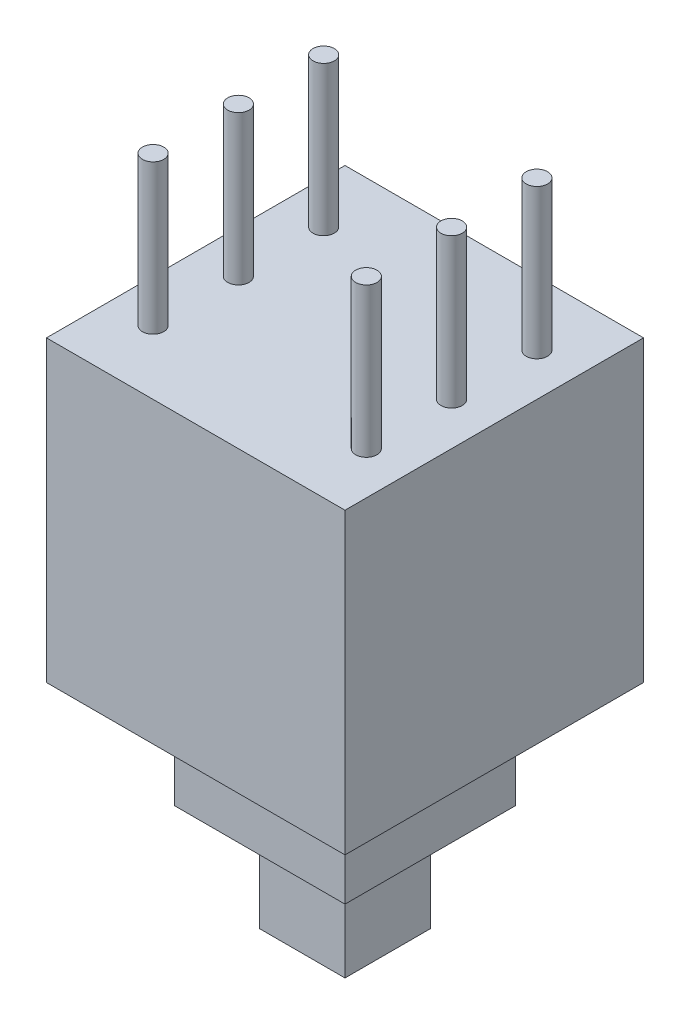
ISO-10303-21;
HEADER;
FILE_DESCRIPTION(('STEP AP214'),'2;1');
FILE_NAME('part.step','',(''),(''),'','','');
FILE_SCHEMA(('AUTOMOTIVE_DESIGN { 1 0 10303 214 1 1 1 1 }'));
ENDSEC;
DATA;
#1=APPLICATION_CONTEXT('core data for automotive mechanical design processes');
#2=APPLICATION_PROTOCOL_DEFINITION('international standard','automotive_design',2000,#1);
#3=PRODUCT_CONTEXT('',#1,'mechanical');
#4=PRODUCT('Part','Part','',(#3));
#5=PRODUCT_RELATED_PRODUCT_CATEGORY('part','',(#4));
#6=PRODUCT_DEFINITION_FORMATION('','',#4);
#7=PRODUCT_DEFINITION_CONTEXT('part definition',#1,'design');
#8=PRODUCT_DEFINITION('design','',#6,#7);
#9=PRODUCT_DEFINITION_SHAPE('','',#8);
#10=(LENGTH_UNIT() NAMED_UNIT(*) SI_UNIT(.MILLI.,.METRE.));
#11=(NAMED_UNIT(*) PLANE_ANGLE_UNIT() SI_UNIT($,.RADIAN.));
#12=(NAMED_UNIT(*) SI_UNIT($,.STERADIAN.) SOLID_ANGLE_UNIT());
#13=UNCERTAINTY_MEASURE_WITH_UNIT(LENGTH_MEASURE(1.E-05),#10,'distance_accuracy_value','');
#14=(GEOMETRIC_REPRESENTATION_CONTEXT(3) GLOBAL_UNCERTAINTY_ASSIGNED_CONTEXT((#13)) GLOBAL_UNIT_ASSIGNED_CONTEXT((#10,
#11,#12)) REPRESENTATION_CONTEXT('',''));
#15=CARTESIAN_POINT('',(0.,0.,0.));
#16=DIRECTION('',(0.,0.,1.));
#17=DIRECTION('',(1.,0.,0.));
#18=AXIS2_PLACEMENT_3D('',#15,#16,#17);
#19=CARTESIAN_POINT('',(1.,-5.,1.));
#20=DIRECTION('',(0.,1.,0.));
#21=DIRECTION('',(0.,0.,1.));
#22=AXIS2_PLACEMENT_3D('',#19,#20,#21);
#23=PLANE('',#22);
#24=DIRECTION('',(-1.,0.,0.));
#25=VECTOR('',#24,1.);
#26=CARTESIAN_POINT('',(-1.,-5.,1.));
#27=LINE('',#26,#25);
#28=CARTESIAN_POINT('',(1.,-5.,1.));
#29=VERTEX_POINT('',#28);
#30=CARTESIAN_POINT('',(-1.,-5.,1.));
#31=VERTEX_POINT('',#30);
#32=EDGE_CURVE('E105',#29,#31,#27,.T.);
#33=ORIENTED_EDGE('',*,*,#32,.T.);
#34=DIRECTION('',(0.,0.,-1.));
#35=VECTOR('',#34,1.);
#36=CARTESIAN_POINT('',(-1.,-5.,-1.));
#37=LINE('',#36,#35);
#38=CARTESIAN_POINT('',(-1.,-5.,-1.));
#39=VERTEX_POINT('',#38);
#40=EDGE_CURVE('E102',#31,#39,#37,.T.);
#41=ORIENTED_EDGE('',*,*,#40,.T.);
#42=DIRECTION('',(1.,0.,0.));
#43=VECTOR('',#42,1.);
#44=CARTESIAN_POINT('',(-1.,-5.,-1.));
#45=LINE('',#44,#43);
#46=CARTESIAN_POINT('',(1.,-5.,-1.));
#47=VERTEX_POINT('',#46);
#48=EDGE_CURVE('E188',#39,#47,#45,.T.);
#49=ORIENTED_EDGE('',*,*,#48,.T.);
#50=DIRECTION('',(0.,0.,1.));
#51=VECTOR('',#50,1.);
#52=CARTESIAN_POINT('',(1.,-5.,-1.));
#53=LINE('',#52,#51);
#54=EDGE_CURVE('E107',#47,#29,#53,.T.);
#55=ORIENTED_EDGE('',*,*,#54,.T.);
#56=EDGE_LOOP('',(#33,#41,#49,#55));
#57=FACE_BOUND('',#56,.T.);
#58=ADVANCED_FACE('F17',(#57),#23,.F.);
#59=CARTESIAN_POINT('',(-1.,-5.,1.));
#60=DIRECTION('',(0.,0.,-1.));
#61=DIRECTION('',(-1.,0.,0.));
#62=AXIS2_PLACEMENT_3D('',#59,#60,#61);
#63=PLANE('',#62);
#64=DIRECTION('',(0.,1.,0.));
#65=VECTOR('',#64,1.);
#66=CARTESIAN_POINT('',(-1.,-5.,1.));
#67=LINE('',#66,#65);
#68=CARTESIAN_POINT('',(-1.,-2.5,1.));
#69=VERTEX_POINT('',#68);
#70=EDGE_CURVE('E112',#69,#31,#67,.F.);
#71=ORIENTED_EDGE('',*,*,#70,.T.);
#72=ORIENTED_EDGE('',*,*,#32,.F.);
#73=DIRECTION('',(0.,1.,0.));
#74=VECTOR('',#73,1.);
#75=CARTESIAN_POINT('',(1.,-5.,1.));
#76=LINE('',#75,#74);
#77=CARTESIAN_POINT('',(1.,-2.5,1.));
#78=VERTEX_POINT('',#77);
#79=EDGE_CURVE('E182',#29,#78,#76,.T.);
#80=ORIENTED_EDGE('',*,*,#79,.T.);
#81=DIRECTION('',(1.,0.,0.));
#82=VECTOR('',#81,1.);
#83=CARTESIAN_POINT('',(2.,-2.5,1.));
#84=LINE('',#83,#82);
#85=EDGE_CURVE('E123',#78,#69,#84,.F.);
#86=ORIENTED_EDGE('',*,*,#85,.T.);
#87=EDGE_LOOP('',(#71,#72,#80,#86));
#88=FACE_BOUND('',#87,.T.);
#89=ADVANCED_FACE('F122',(#88),#63,.F.);
#90=CARTESIAN_POINT('',(-1.,-5.,-1.));
#91=DIRECTION('',(1.,0.,0.));
#92=DIRECTION('',(0.,0.,-1.));
#93=AXIS2_PLACEMENT_3D('',#90,#91,#92);
#94=PLANE('',#93);
#95=DIRECTION('',(0.,1.,0.));
#96=VECTOR('',#95,1.);
#97=CARTESIAN_POINT('',(-1.,-5.,-1.));
#98=LINE('',#97,#96);
#99=CARTESIAN_POINT('',(-1.,-2.5,-1.));
#100=VERTEX_POINT('',#99);
#101=EDGE_CURVE('E119',#100,#39,#98,.F.);
#102=ORIENTED_EDGE('',*,*,#101,.T.);
#103=ORIENTED_EDGE('',*,*,#40,.F.);
#104=ORIENTED_EDGE('',*,*,#70,.F.);
#105=DIRECTION('',(0.,0.,1.));
#106=VECTOR('',#105,1.);
#107=CARTESIAN_POINT('',(-1.,-2.5,2.));
#108=LINE('',#107,#106);
#109=EDGE_CURVE('E175',#69,#100,#108,.F.);
#110=ORIENTED_EDGE('',*,*,#109,.T.);
#111=EDGE_LOOP('',(#102,#103,#104,#110));
#112=FACE_BOUND('',#111,.T.);
#113=ADVANCED_FACE('F116',(#112),#94,.F.);
#114=CARTESIAN_POINT('',(-1.,-5.,-1.));
#115=DIRECTION('',(0.,0.,1.));
#116=DIRECTION('',(1.,0.,0.));
#117=AXIS2_PLACEMENT_3D('',#114,#115,#116);
#118=PLANE('',#117);
#119=DIRECTION('',(0.,1.,0.));
#120=VECTOR('',#119,1.);
#121=CARTESIAN_POINT('',(1.,-5.,-1.));
#122=LINE('',#121,#120);
#123=CARTESIAN_POINT('',(1.,-2.5,-1.));
#124=VERTEX_POINT('',#123);
#125=EDGE_CURVE('E185',#124,#47,#122,.F.);
#126=ORIENTED_EDGE('',*,*,#125,.T.);
#127=ORIENTED_EDGE('',*,*,#48,.F.);
#128=ORIENTED_EDGE('',*,*,#101,.F.);
#129=DIRECTION('',(1.,0.,0.));
#130=VECTOR('',#129,1.);
#131=CARTESIAN_POINT('',(2.,-2.5,-1.));
#132=LINE('',#131,#130);
#133=EDGE_CURVE('E170',#100,#124,#132,.T.);
#134=ORIENTED_EDGE('',*,*,#133,.T.);
#135=EDGE_LOOP('',(#126,#127,#128,#134));
#136=FACE_BOUND('',#135,.T.);
#137=ADVANCED_FACE('F191',(#136),#118,.F.);
#138=CARTESIAN_POINT('',(1.,-5.,-1.));
#139=DIRECTION('',(-1.,0.,0.));
#140=DIRECTION('',(0.,0.,1.));
#141=AXIS2_PLACEMENT_3D('',#138,#139,#140);
#142=PLANE('',#141);
#143=ORIENTED_EDGE('',*,*,#79,.F.);
#144=ORIENTED_EDGE('',*,*,#54,.F.);
#145=ORIENTED_EDGE('',*,*,#125,.F.);
#146=DIRECTION('',(0.,0.,1.));
#147=VECTOR('',#146,1.);
#148=CARTESIAN_POINT('',(1.,-2.5,2.));
#149=LINE('',#148,#147);
#150=EDGE_CURVE('E166',#124,#78,#149,.T.);
#151=ORIENTED_EDGE('',*,*,#150,.T.);
#152=EDGE_LOOP('',(#143,#144,#145,#151));
#153=FACE_BOUND('',#152,.T.);
#154=ADVANCED_FACE('F190',(#153),#142,.F.);
#155=CARTESIAN_POINT('',(2.5,10.5,-2.));
#156=DIRECTION('',(0.,-1.,0.));
#157=DIRECTION('',(0.,0.,-1.));
#158=AXIS2_PLACEMENT_3D('',#155,#156,#157);
#159=PLANE('',#158);
#160=CARTESIAN_POINT('',(2.5,10.5,-2.));
#161=DIRECTION('',(0.,-1.,0.));
#162=DIRECTION('',(0.,0.,-1.));
#163=AXIS2_PLACEMENT_3D('',#160,#161,#162);
#164=CIRCLE('',#163,0.25);
#165=CARTESIAN_POINT('',(2.5,10.5,-2.25));
#166=VERTEX_POINT('',#165);
#167=EDGE_CURVE('E20',#166,#166,#164,.T.);
#168=ORIENTED_EDGE('',*,*,#167,.F.);
#169=EDGE_LOOP('',(#168));
#170=FACE_BOUND('',#169,.T.);
#171=ADVANCED_FACE('F351',(#170),#159,.F.);
#172=CARTESIAN_POINT('',(-2.5,10.5,2.));
#173=DIRECTION('',(0.,1.,0.));
#174=DIRECTION('',(0.,0.,1.));
#175=AXIS2_PLACEMENT_3D('',#172,#173,#174);
#176=PLANE('',#175);
#177=CARTESIAN_POINT('',(-2.5,10.5,2.));
#178=DIRECTION('',(0.,-1.,0.));
#179=DIRECTION('',(0.,0.,-1.));
#180=AXIS2_PLACEMENT_3D('',#177,#178,#179);
#181=CIRCLE('',#180,0.25);
#182=CARTESIAN_POINT('',(-2.5,10.5,1.75));
#183=VERTEX_POINT('',#182);
#184=EDGE_CURVE('E161',#183,#183,#181,.T.);
#185=ORIENTED_EDGE('',*,*,#184,.F.);
#186=EDGE_LOOP('',(#185));
#187=FACE_BOUND('',#186,.T.);
#188=ADVANCED_FACE('F347',(#187),#176,.T.);
#189=CARTESIAN_POINT('',(-2.5,10.5,0.));
#190=DIRECTION('',(0.,1.,0.));
#191=DIRECTION('',(0.,0.,1.));
#192=AXIS2_PLACEMENT_3D('',#189,#190,#191);
#193=PLANE('',#192);
#194=CARTESIAN_POINT('',(-2.5,10.5,0.));
#195=DIRECTION('',(0.,-1.,0.));
#196=DIRECTION('',(0.,0.,-1.));
#197=AXIS2_PLACEMENT_3D('',#194,#195,#196);
#198=CIRCLE('',#197,0.25);
#199=CARTESIAN_POINT('',(-2.5,10.5,-0.249999999999996));
#200=VERTEX_POINT('',#199);
#201=EDGE_CURVE('E159',#200,#200,#198,.T.);
#202=ORIENTED_EDGE('',*,*,#201,.F.);
#203=EDGE_LOOP('',(#202));
#204=FACE_BOUND('',#203,.T.);
#205=ADVANCED_FACE('F343',(#204),#193,.T.);
#206=CARTESIAN_POINT('',(-2.5,10.5,-2.));
#207=DIRECTION('',(0.,1.,0.));
#208=DIRECTION('',(0.,0.,1.));
#209=AXIS2_PLACEMENT_3D('',#206,#207,#208);
#210=PLANE('',#209);
#211=CARTESIAN_POINT('',(-2.5,10.5,-2.));
#212=DIRECTION('',(0.,-1.,0.));
#213=DIRECTION('',(0.,0.,-1.));
#214=AXIS2_PLACEMENT_3D('',#211,#212,#213);
#215=CIRCLE('',#214,0.25);
#216=CARTESIAN_POINT('',(-2.5,10.5,-2.25));
#217=VERTEX_POINT('',#216);
#218=EDGE_CURVE('E156',#217,#217,#215,.T.);
#219=ORIENTED_EDGE('',*,*,#218,.F.);
#220=EDGE_LOOP('',(#219));
#221=FACE_BOUND('',#220,.T.);
#222=ADVANCED_FACE('F339',(#221),#210,.T.);
#223=CARTESIAN_POINT('',(2.5,10.5,2.));
#224=DIRECTION('',(0.,-1.,0.));
#225=DIRECTION('',(0.,0.,-1.));
#226=AXIS2_PLACEMENT_3D('',#223,#224,#225);
#227=PLANE('',#226);
#228=CARTESIAN_POINT('',(2.5,10.5,2.));
#229=DIRECTION('',(0.,-1.,0.));
#230=DIRECTION('',(0.,0.,-1.));
#231=AXIS2_PLACEMENT_3D('',#228,#229,#230);
#232=CIRCLE('',#231,0.25);
#233=CARTESIAN_POINT('',(2.5,10.5,1.75));
#234=VERTEX_POINT('',#233);
#235=EDGE_CURVE('E153',#234,#234,#232,.T.);
#236=ORIENTED_EDGE('',*,*,#235,.F.);
#237=EDGE_LOOP('',(#236));
#238=FACE_BOUND('',#237,.T.);
#239=ADVANCED_FACE('F335',(#238),#227,.F.);
#240=CARTESIAN_POINT('',(2.5,10.5,0.));
#241=DIRECTION('',(0.,-1.,0.));
#242=DIRECTION('',(0.,0.,-1.));
#243=AXIS2_PLACEMENT_3D('',#240,#241,#242);
#244=PLANE('',#243);
#245=CARTESIAN_POINT('',(2.5,10.5,0.));
#246=DIRECTION('',(0.,-1.,0.));
#247=DIRECTION('',(0.,0.,-1.));
#248=AXIS2_PLACEMENT_3D('',#245,#246,#247);
#249=CIRCLE('',#248,0.25);
#250=CARTESIAN_POINT('',(2.5,10.5,-0.249999999999997));
#251=VERTEX_POINT('',#250);
#252=EDGE_CURVE('E149',#251,#251,#249,.T.);
#253=ORIENTED_EDGE('',*,*,#252,.F.);
#254=EDGE_LOOP('',(#253));
#255=FACE_BOUND('',#254,.T.);
#256=ADVANCED_FACE('F198',(#255),#244,.F.);
#257=CARTESIAN_POINT('',(2.,-2.5,2.));
#258=DIRECTION('',(0.,1.,0.));
#259=DIRECTION('',(0.,0.,1.));
#260=AXIS2_PLACEMENT_3D('',#257,#258,#259);
#261=PLANE('',#260);
#262=ORIENTED_EDGE('',*,*,#133,.F.);
#263=ORIENTED_EDGE('',*,*,#109,.F.);
#264=ORIENTED_EDGE('',*,*,#85,.F.);
#265=ORIENTED_EDGE('',*,*,#150,.F.);
#266=EDGE_LOOP('',(#262,#263,#264,#265));
#267=FACE_BOUND('',#266,.T.);
#268=DIRECTION('',(-1.,0.,0.));
#269=VECTOR('',#268,1.);
#270=CARTESIAN_POINT('',(-2.,-2.5,2.));
#271=LINE('',#270,#269);
#272=CARTESIAN_POINT('',(2.,-2.5,2.));
#273=VERTEX_POINT('',#272);
#274=CARTESIAN_POINT('',(-2.,-2.5,2.));
#275=VERTEX_POINT('',#274);
#276=EDGE_CURVE('E152',#273,#275,#271,.T.);
#277=ORIENTED_EDGE('',*,*,#276,.T.);
#278=DIRECTION('',(0.,0.,-1.));
#279=VECTOR('',#278,1.);
#280=CARTESIAN_POINT('',(-2.,-2.5,-2.));
#281=LINE('',#280,#279);
#282=CARTESIAN_POINT('',(-2.,-2.5,-2.));
#283=VERTEX_POINT('',#282);
#284=EDGE_CURVE('E204',#275,#283,#281,.T.);
#285=ORIENTED_EDGE('',*,*,#284,.T.);
#286=DIRECTION('',(1.,0.,0.));
#287=VECTOR('',#286,1.);
#288=CARTESIAN_POINT('',(-2.,-2.5,-2.));
#289=LINE('',#288,#287);
#290=CARTESIAN_POINT('',(2.,-2.5,-2.));
#291=VERTEX_POINT('',#290);
#292=EDGE_CURVE('E225',#283,#291,#289,.T.);
#293=ORIENTED_EDGE('',*,*,#292,.T.);
#294=DIRECTION('',(0.,0.,1.));
#295=VECTOR('',#294,1.);
#296=CARTESIAN_POINT('',(2.,-2.5,-2.));
#297=LINE('',#296,#295);
#298=EDGE_CURVE('E205',#291,#273,#297,.T.);
#299=ORIENTED_EDGE('',*,*,#298,.T.);
#300=EDGE_LOOP('',(#277,#285,#293,#299));
#301=FACE_BOUND('',#300,.T.);
#302=ADVANCED_FACE('F194',(#267,#301),#261,.F.);
#303=CARTESIAN_POINT('',(2.5,10.5,-2.));
#304=DIRECTION('',(0.,-1.,0.));
#305=DIRECTION('',(0.,0.,-1.));
#306=AXIS2_PLACEMENT_3D('',#303,#304,#305);
#307=CYLINDRICAL_SURFACE('',#306,0.25);
#308=ORIENTED_EDGE('',*,*,#167,.T.);
#309=EDGE_LOOP('',(#308));
#310=FACE_BOUND('',#309,.T.);
#311=CARTESIAN_POINT('',(2.5,7.,-2.));
#312=DIRECTION('',(0.,-1.,0.));
#313=DIRECTION('',(0.,0.,-1.));
#314=AXIS2_PLACEMENT_3D('',#311,#312,#313);
#315=CIRCLE('',#314,0.25);
#316=CARTESIAN_POINT('',(2.5,7.,-2.25));
#317=VERTEX_POINT('',#316);
#318=EDGE_CURVE('E145',#317,#317,#315,.F.);
#319=ORIENTED_EDGE('',*,*,#318,.T.);
#320=EDGE_LOOP('',(#319));
#321=FACE_BOUND('',#320,.T.);
#322=ADVANCED_FACE('F197',(#310,#321),#307,.T.);
#323=CARTESIAN_POINT('',(-2.5,10.5,2.));
#324=DIRECTION('',(0.,-1.,0.));
#325=DIRECTION('',(0.,0.,-1.));
#326=AXIS2_PLACEMENT_3D('',#323,#324,#325);
#327=CYLINDRICAL_SURFACE('',#326,0.25);
#328=ORIENTED_EDGE('',*,*,#184,.T.);
#329=EDGE_LOOP('',(#328));
#330=FACE_BOUND('',#329,.T.);
#331=CARTESIAN_POINT('',(-2.5,7.,2.));
#332=DIRECTION('',(0.,-1.,0.));
#333=DIRECTION('',(0.,0.,-1.));
#334=AXIS2_PLACEMENT_3D('',#331,#332,#333);
#335=CIRCLE('',#334,0.25);
#336=CARTESIAN_POINT('',(-2.5,7.,1.75));
#337=VERTEX_POINT('',#336);
#338=EDGE_CURVE('E142',#337,#337,#335,.F.);
#339=ORIENTED_EDGE('',*,*,#338,.T.);
#340=EDGE_LOOP('',(#339));
#341=FACE_BOUND('',#340,.T.);
#342=ADVANCED_FACE('F327',(#330,#341),#327,.T.);
#343=CARTESIAN_POINT('',(-2.5,10.5,0.));
#344=DIRECTION('',(0.,-1.,0.));
#345=DIRECTION('',(0.,0.,-1.));
#346=AXIS2_PLACEMENT_3D('',#343,#344,#345);
#347=CYLINDRICAL_SURFACE('',#346,0.25);
#348=ORIENTED_EDGE('',*,*,#201,.T.);
#349=EDGE_LOOP('',(#348));
#350=FACE_BOUND('',#349,.T.);
#351=CARTESIAN_POINT('',(-2.5,7.,0.));
#352=DIRECTION('',(0.,-1.,0.));
#353=DIRECTION('',(0.,0.,-1.));
#354=AXIS2_PLACEMENT_3D('',#351,#352,#353);
#355=CIRCLE('',#354,0.25);
#356=CARTESIAN_POINT('',(-2.5,7.,-0.249999999999996));
#357=VERTEX_POINT('',#356);
#358=EDGE_CURVE('E138',#357,#357,#355,.F.);
#359=ORIENTED_EDGE('',*,*,#358,.T.);
#360=EDGE_LOOP('',(#359));
#361=FACE_BOUND('',#360,.T.);
#362=ADVANCED_FACE('F323',(#350,#361),#347,.T.);
#363=CARTESIAN_POINT('',(-2.5,10.5,-2.));
#364=DIRECTION('',(0.,-1.,0.));
#365=DIRECTION('',(0.,0.,-1.));
#366=AXIS2_PLACEMENT_3D('',#363,#364,#365);
#367=CYLINDRICAL_SURFACE('',#366,0.25);
#368=ORIENTED_EDGE('',*,*,#218,.T.);
#369=EDGE_LOOP('',(#368));
#370=FACE_BOUND('',#369,.T.);
#371=CARTESIAN_POINT('',(-2.5,7.,-2.));
#372=DIRECTION('',(0.,-1.,0.));
#373=DIRECTION('',(0.,0.,-1.));
#374=AXIS2_PLACEMENT_3D('',#371,#372,#373);
#375=CIRCLE('',#374,0.25);
#376=CARTESIAN_POINT('',(-2.5,7.,-2.25));
#377=VERTEX_POINT('',#376);
#378=EDGE_CURVE('E134',#377,#377,#375,.F.);
#379=ORIENTED_EDGE('',*,*,#378,.T.);
#380=EDGE_LOOP('',(#379));
#381=FACE_BOUND('',#380,.T.);
#382=ADVANCED_FACE('F319',(#370,#381),#367,.T.);
#383=CARTESIAN_POINT('',(2.5,10.5,2.));
#384=DIRECTION('',(0.,-1.,0.));
#385=DIRECTION('',(0.,0.,-1.));
#386=AXIS2_PLACEMENT_3D('',#383,#384,#385);
#387=CYLINDRICAL_SURFACE('',#386,0.25);
#388=ORIENTED_EDGE('',*,*,#235,.T.);
#389=EDGE_LOOP('',(#388));
#390=FACE_BOUND('',#389,.T.);
#391=CARTESIAN_POINT('',(2.5,7.,2.));
#392=DIRECTION('',(0.,-1.,0.));
#393=DIRECTION('',(0.,0.,-1.));
#394=AXIS2_PLACEMENT_3D('',#391,#392,#393);
#395=CIRCLE('',#394,0.25);
#396=CARTESIAN_POINT('',(2.5,7.,1.75));
#397=VERTEX_POINT('',#396);
#398=EDGE_CURVE('E131',#397,#397,#395,.F.);
#399=ORIENTED_EDGE('',*,*,#398,.T.);
#400=EDGE_LOOP('',(#399));
#401=FACE_BOUND('',#400,.T.);
#402=ADVANCED_FACE('F315',(#390,#401),#387,.T.);
#403=CARTESIAN_POINT('',(2.5,10.5,0.));
#404=DIRECTION('',(0.,-1.,0.));
#405=DIRECTION('',(0.,0.,-1.));
#406=AXIS2_PLACEMENT_3D('',#403,#404,#405);
#407=CYLINDRICAL_SURFACE('',#406,0.25);
#408=ORIENTED_EDGE('',*,*,#252,.T.);
#409=EDGE_LOOP('',(#408));
#410=FACE_BOUND('',#409,.T.);
#411=CARTESIAN_POINT('',(2.5,7.,0.));
#412=DIRECTION('',(0.,-1.,0.));
#413=DIRECTION('',(0.,0.,-1.));
#414=AXIS2_PLACEMENT_3D('',#411,#412,#413);
#415=CIRCLE('',#414,0.25);
#416=CARTESIAN_POINT('',(2.5,7.,-0.249999999999997));
#417=VERTEX_POINT('',#416);
#418=EDGE_CURVE('E127',#417,#417,#415,.F.);
#419=ORIENTED_EDGE('',*,*,#418,.T.);
#420=EDGE_LOOP('',(#419));
#421=FACE_BOUND('',#420,.T.);
#422=ADVANCED_FACE('F311',(#410,#421),#407,.T.);
#423=CARTESIAN_POINT('',(-3.50000000000001,7.,3.5));
#424=DIRECTION('',(1.,0.,0.));
#425=DIRECTION('',(0.,0.,-1.));
#426=AXIS2_PLACEMENT_3D('',#423,#424,#425);
#427=PLANE('',#426);
#428=DIRECTION('',(0.,1.,0.));
#429=VECTOR('',#428,1.);
#430=CARTESIAN_POINT('',(-3.50000000000001,7.,3.5));
#431=LINE('',#430,#429);
#432=CARTESIAN_POINT('',(-3.50000000000001,0.,3.5));
#433=VERTEX_POINT('',#432);
#434=CARTESIAN_POINT('',(-3.50000000000001,7.,3.5));
#435=VERTEX_POINT('',#434);
#436=EDGE_CURVE('E148',#433,#435,#431,.T.);
#437=ORIENTED_EDGE('',*,*,#436,.T.);
#438=DIRECTION('',(0.,0.,-1.));
#439=VECTOR('',#438,1.);
#440=CARTESIAN_POINT('',(-3.50000000000001,7.,-3.5));
#441=LINE('',#440,#439);
#442=CARTESIAN_POINT('',(-3.50000000000001,7.,-3.5));
#443=VERTEX_POINT('',#442);
#444=EDGE_CURVE('E137',#435,#443,#441,.T.);
#445=ORIENTED_EDGE('',*,*,#444,.T.);
#446=DIRECTION('',(0.,1.,0.));
#447=VECTOR('',#446,1.);
#448=CARTESIAN_POINT('',(-3.50000000000001,7.,-3.5));
#449=LINE('',#448,#447);
#450=CARTESIAN_POINT('',(-3.50000000000001,0.,-3.5));
#451=VERTEX_POINT('',#450);
#452=EDGE_CURVE('E251',#443,#451,#449,.F.);
#453=ORIENTED_EDGE('',*,*,#452,.T.);
#454=DIRECTION('',(0.,0.,-1.));
#455=VECTOR('',#454,1.);
#456=CARTESIAN_POINT('',(-3.50000000000001,0.,-3.5));
#457=LINE('',#456,#455);
#458=EDGE_CURVE('E246',#433,#451,#457,.T.);
#459=ORIENTED_EDGE('',*,*,#458,.F.);
#460=EDGE_LOOP('',(#437,#445,#453,#459));
#461=FACE_BOUND('',#460,.T.);
#462=ADVANCED_FACE('F308',(#461),#427,.F.);
#463=CARTESIAN_POINT('',(-2.,-2.5,2.));
#464=DIRECTION('',(0.,0.,-1.));
#465=DIRECTION('',(-1.,0.,0.));
#466=AXIS2_PLACEMENT_3D('',#463,#464,#465);
#467=PLANE('',#466);
#468=DIRECTION('',(0.,1.,0.));
#469=VECTOR('',#468,1.);
#470=CARTESIAN_POINT('',(-2.,-2.5,2.));
#471=LINE('',#470,#469);
#472=CARTESIAN_POINT('',(-2.,0.,2.));
#473=VERTEX_POINT('',#472);
#474=EDGE_CURVE('E214',#473,#275,#471,.F.);
#475=ORIENTED_EDGE('',*,*,#474,.T.);
#476=ORIENTED_EDGE('',*,*,#276,.F.);
#477=DIRECTION('',(0.,1.,0.));
#478=VECTOR('',#477,1.);
#479=CARTESIAN_POINT('',(2.,-2.5,2.));
#480=LINE('',#479,#478);
#481=CARTESIAN_POINT('',(2.,0.,2.));
#482=VERTEX_POINT('',#481);
#483=EDGE_CURVE('E230',#273,#482,#480,.T.);
#484=ORIENTED_EDGE('',*,*,#483,.T.);
#485=DIRECTION('',(1.,0.,0.));
#486=VECTOR('',#485,1.);
#487=CARTESIAN_POINT('',(3.49999999999999,0.,2.));
#488=LINE('',#487,#486);
#489=EDGE_CURVE('E221',#473,#482,#488,.T.);
#490=ORIENTED_EDGE('',*,*,#489,.F.);
#491=EDGE_LOOP('',(#475,#476,#484,#490));
#492=FACE_BOUND('',#491,.T.);
#493=ADVANCED_FACE('F220',(#492),#467,.F.);
#494=CARTESIAN_POINT('',(2.,-2.5,-2.));
#495=DIRECTION('',(-1.,0.,0.));
#496=DIRECTION('',(0.,0.,1.));
#497=AXIS2_PLACEMENT_3D('',#494,#495,#496);
#498=PLANE('',#497);
#499=ORIENTED_EDGE('',*,*,#483,.F.);
#500=ORIENTED_EDGE('',*,*,#298,.F.);
#501=DIRECTION('',(0.,1.,0.));
#502=VECTOR('',#501,1.);
#503=CARTESIAN_POINT('',(2.,-2.5,-2.));
#504=LINE('',#503,#502);
#505=CARTESIAN_POINT('',(2.,0.,-2.));
#506=VERTEX_POINT('',#505);
#507=EDGE_CURVE('E222',#291,#506,#504,.T.);
#508=ORIENTED_EDGE('',*,*,#507,.T.);
#509=DIRECTION('',(0.,0.,-1.));
#510=VECTOR('',#509,1.);
#511=CARTESIAN_POINT('',(2.,0.,-3.5));
#512=LINE('',#511,#510);
#513=EDGE_CURVE('E233',#482,#506,#512,.T.);
#514=ORIENTED_EDGE('',*,*,#513,.F.);
#515=EDGE_LOOP('',(#499,#500,#508,#514));
#516=FACE_BOUND('',#515,.T.);
#517=ADVANCED_FACE('F234',(#516),#498,.F.);
#518=CARTESIAN_POINT('',(-2.,-2.5,-2.));
#519=DIRECTION('',(0.,0.,1.));
#520=DIRECTION('',(1.,0.,0.));
#521=AXIS2_PLACEMENT_3D('',#518,#519,#520);
#522=PLANE('',#521);
#523=ORIENTED_EDGE('',*,*,#507,.F.);
#524=ORIENTED_EDGE('',*,*,#292,.F.);
#525=DIRECTION('',(0.,1.,0.));
#526=VECTOR('',#525,1.);
#527=CARTESIAN_POINT('',(-2.,-2.5,-2.));
#528=LINE('',#527,#526);
#529=CARTESIAN_POINT('',(-2.,0.,-2.));
#530=VERTEX_POINT('',#529);
#531=EDGE_CURVE('E217',#283,#530,#528,.T.);
#532=ORIENTED_EDGE('',*,*,#531,.T.);
#533=DIRECTION('',(1.,0.,0.));
#534=VECTOR('',#533,1.);
#535=CARTESIAN_POINT('',(3.49999999999999,0.,-2.));
#536=LINE('',#535,#534);
#537=EDGE_CURVE('E238',#506,#530,#536,.F.);
#538=ORIENTED_EDGE('',*,*,#537,.F.);
#539=EDGE_LOOP('',(#523,#524,#532,#538));
#540=FACE_BOUND('',#539,.T.);
#541=ADVANCED_FACE('F260',(#540),#522,.F.);
#542=CARTESIAN_POINT('',(-2.,-2.5,-2.));
#543=DIRECTION('',(1.,0.,0.));
#544=DIRECTION('',(0.,0.,-1.));
#545=AXIS2_PLACEMENT_3D('',#542,#543,#544);
#546=PLANE('',#545);
#547=ORIENTED_EDGE('',*,*,#531,.F.);
#548=ORIENTED_EDGE('',*,*,#284,.F.);
#549=ORIENTED_EDGE('',*,*,#474,.F.);
#550=DIRECTION('',(0.,0.,-1.));
#551=VECTOR('',#550,1.);
#552=CARTESIAN_POINT('',(-2.,0.,-3.5));
#553=LINE('',#552,#551);
#554=EDGE_CURVE('E240',#530,#473,#553,.F.);
#555=ORIENTED_EDGE('',*,*,#554,.F.);
#556=EDGE_LOOP('',(#547,#548,#549,#555));
#557=FACE_BOUND('',#556,.T.);
#558=ADVANCED_FACE('F212',(#557),#546,.F.);
#559=CARTESIAN_POINT('',(-3.50000000000001,7.,3.5));
#560=DIRECTION('',(0.,0.,-1.));
#561=DIRECTION('',(-1.,0.,0.));
#562=AXIS2_PLACEMENT_3D('',#559,#560,#561);
#563=PLANE('',#562);
#564=DIRECTION('',(0.,1.,0.));
#565=VECTOR('',#564,1.);
#566=CARTESIAN_POINT('',(3.49999999999999,7.,3.5));
#567=LINE('',#566,#565);
#568=CARTESIAN_POINT('',(3.49999999999999,0.,3.5));
#569=VERTEX_POINT('',#568);
#570=CARTESIAN_POINT('',(3.49999999999999,7.,3.5));
#571=VERTEX_POINT('',#570);
#572=EDGE_CURVE('E261',#569,#571,#567,.T.);
#573=ORIENTED_EDGE('',*,*,#572,.T.);
#574=DIRECTION('',(1.,0.,0.));
#575=VECTOR('',#574,1.);
#576=CARTESIAN_POINT('',(3.49999999999999,7.,3.5));
#577=LINE('',#576,#575);
#578=EDGE_CURVE('E141',#571,#435,#577,.F.);
#579=ORIENTED_EDGE('',*,*,#578,.T.);
#580=ORIENTED_EDGE('',*,*,#436,.F.);
#581=DIRECTION('',(1.,0.,0.));
#582=VECTOR('',#581,1.);
#583=CARTESIAN_POINT('',(3.49999999999999,0.,3.5));
#584=LINE('',#583,#582);
#585=EDGE_CURVE('E248',#569,#433,#584,.F.);
#586=ORIENTED_EDGE('',*,*,#585,.F.);
#587=EDGE_LOOP('',(#573,#579,#580,#586));
#588=FACE_BOUND('',#587,.T.);
#589=ADVANCED_FACE('F281',(#588),#563,.F.);
#590=CARTESIAN_POINT('',(3.49999999999999,7.,-3.5));
#591=DIRECTION('',(0.,-1.,0.));
#592=DIRECTION('',(0.,0.,-1.));
#593=AXIS2_PLACEMENT_3D('',#590,#591,#592);
#594=PLANE('',#593);
#595=ORIENTED_EDGE('',*,*,#418,.F.);
#596=EDGE_LOOP('',(#595));
#597=FACE_BOUND('',#596,.T.);
#598=ORIENTED_EDGE('',*,*,#398,.F.);
#599=EDGE_LOOP('',(#598));
#600=FACE_BOUND('',#599,.T.);
#601=ORIENTED_EDGE('',*,*,#378,.F.);
#602=EDGE_LOOP('',(#601));
#603=FACE_BOUND('',#602,.T.);
#604=DIRECTION('',(1.,0.,0.));
#605=VECTOR('',#604,1.);
#606=CARTESIAN_POINT('',(-3.50000000000001,7.,-3.5));
#607=LINE('',#606,#605);
#608=CARTESIAN_POINT('',(3.49999999999999,7.,-3.5));
#609=VERTEX_POINT('',#608);
#610=EDGE_CURVE('E130',#609,#443,#607,.F.);
#611=ORIENTED_EDGE('',*,*,#610,.T.);
#612=ORIENTED_EDGE('',*,*,#444,.F.);
#613=ORIENTED_EDGE('',*,*,#578,.F.);
#614=DIRECTION('',(0.,0.,1.));
#615=VECTOR('',#614,1.);
#616=CARTESIAN_POINT('',(3.49999999999999,7.,3.5));
#617=LINE('',#616,#615);
#618=EDGE_CURVE('E263',#571,#609,#617,.F.);
#619=ORIENTED_EDGE('',*,*,#618,.T.);
#620=EDGE_LOOP('',(#611,#612,#613,#619));
#621=FACE_BOUND('',#620,.T.);
#622=ORIENTED_EDGE('',*,*,#358,.F.);
#623=EDGE_LOOP('',(#622));
#624=FACE_BOUND('',#623,.T.);
#625=ORIENTED_EDGE('',*,*,#338,.F.);
#626=EDGE_LOOP('',(#625));
#627=FACE_BOUND('',#626,.T.);
#628=ORIENTED_EDGE('',*,*,#318,.F.);
#629=EDGE_LOOP('',(#628));
#630=FACE_BOUND('',#629,.T.);
#631=ADVANCED_FACE('F277',(#597,#600,#603,#621,#624,#627,#630),#594,.F.);
#632=CARTESIAN_POINT('',(-3.50000000000001,7.,-3.5));
#633=DIRECTION('',(0.,0.,1.));
#634=DIRECTION('',(1.,0.,0.));
#635=AXIS2_PLACEMENT_3D('',#632,#633,#634);
#636=PLANE('',#635);
#637=ORIENTED_EDGE('',*,*,#452,.F.);
#638=ORIENTED_EDGE('',*,*,#610,.F.);
#639=DIRECTION('',(0.,1.,0.));
#640=VECTOR('',#639,1.);
#641=CARTESIAN_POINT('',(3.49999999999999,7.,-3.5));
#642=LINE('',#641,#640);
#643=CARTESIAN_POINT('',(3.49999999999999,0.,-3.5));
#644=VERTEX_POINT('',#643);
#645=EDGE_CURVE('E26',#609,#644,#642,.F.);
#646=ORIENTED_EDGE('',*,*,#645,.T.);
#647=DIRECTION('',(1.,0.,0.));
#648=VECTOR('',#647,1.);
#649=CARTESIAN_POINT('',(3.49999999999999,0.,-3.5));
#650=LINE('',#649,#648);
#651=EDGE_CURVE('E34',#451,#644,#650,.T.);
#652=ORIENTED_EDGE('',*,*,#651,.F.);
#653=EDGE_LOOP('',(#637,#638,#646,#652));
#654=FACE_BOUND('',#653,.T.);
#655=ADVANCED_FACE('F272',(#654),#636,.F.);
#656=CARTESIAN_POINT('',(3.49999999999999,0.,-3.5));
#657=DIRECTION('',(0.,-1.,0.));
#658=DIRECTION('',(0.,0.,-1.));
#659=AXIS2_PLACEMENT_3D('',#656,#657,#658);
#660=PLANE('',#659);
#661=ORIENTED_EDGE('',*,*,#537,.T.);
#662=ORIENTED_EDGE('',*,*,#554,.T.);
#663=ORIENTED_EDGE('',*,*,#489,.T.);
#664=ORIENTED_EDGE('',*,*,#513,.T.);
#665=EDGE_LOOP('',(#661,#662,#663,#664));
#666=FACE_BOUND('',#665,.T.);
#667=ORIENTED_EDGE('',*,*,#458,.T.);
#668=ORIENTED_EDGE('',*,*,#651,.T.);
#669=DIRECTION('',(0.,0.,1.));
#670=VECTOR('',#669,1.);
#671=CARTESIAN_POINT('',(3.49999999999999,0.,3.5));
#672=LINE('',#671,#670);
#673=EDGE_CURVE('E10',#644,#569,#672,.T.);
#674=ORIENTED_EDGE('',*,*,#673,.T.);
#675=ORIENTED_EDGE('',*,*,#585,.T.);
#676=EDGE_LOOP('',(#667,#668,#674,#675));
#677=FACE_BOUND('',#676,.T.);
#678=ADVANCED_FACE('F284',(#666,#677),#660,.T.);
#679=CARTESIAN_POINT('',(3.49999999999999,7.,3.5));
#680=DIRECTION('',(-1.,0.,0.));
#681=DIRECTION('',(0.,0.,1.));
#682=AXIS2_PLACEMENT_3D('',#679,#680,#681);
#683=PLANE('',#682);
#684=ORIENTED_EDGE('',*,*,#645,.F.);
#685=ORIENTED_EDGE('',*,*,#618,.F.);
#686=ORIENTED_EDGE('',*,*,#572,.F.);
#687=ORIENTED_EDGE('',*,*,#673,.F.);
#688=EDGE_LOOP('',(#684,#685,#686,#687));
#689=FACE_BOUND('',#688,.T.);
#690=ADVANCED_FACE('F275',(#689),#683,.F.);
#691=CLOSED_SHELL('',(#58,#89,#113,#137,#154,#171,#188,#205,#222,#239,#256,#302,#322,#342,#362,
#382,#402,#422,#462,#493,#517,#541,#558,#589,#631,#655,#678,#690));
#692=MANIFOLD_SOLID_BREP('B1',#691);
#693=ADVANCED_BREP_SHAPE_REPRESENTATION('',(#18,#692),#14);
#694=SHAPE_DEFINITION_REPRESENTATION(#9,#693);
ENDSEC;
END-ISO-10303-21;
